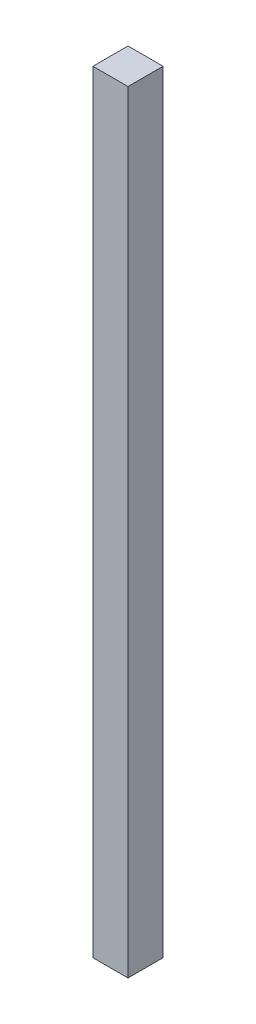
ISO-10303-21;
HEADER;
FILE_DESCRIPTION(('STEP AP214'),'2;1');
FILE_NAME('part.step','',(''),(''),'','','');
FILE_SCHEMA(('AUTOMOTIVE_DESIGN { 1 0 10303 214 1 1 1 1 }'));
ENDSEC;
DATA;
#1=APPLICATION_CONTEXT('core data for automotive mechanical design processes');
#2=APPLICATION_PROTOCOL_DEFINITION('international standard','automotive_design',2000,#1);
#3=PRODUCT_CONTEXT('',#1,'mechanical');
#4=PRODUCT('Part','Part','',(#3));
#5=PRODUCT_RELATED_PRODUCT_CATEGORY('part','',(#4));
#6=PRODUCT_DEFINITION_FORMATION('','',#4);
#7=PRODUCT_DEFINITION_CONTEXT('part definition',#1,'design');
#8=PRODUCT_DEFINITION('design','',#6,#7);
#9=PRODUCT_DEFINITION_SHAPE('','',#8);
#10=(LENGTH_UNIT() NAMED_UNIT(*) SI_UNIT(.MILLI.,.METRE.));
#11=(NAMED_UNIT(*) PLANE_ANGLE_UNIT() SI_UNIT($,.RADIAN.));
#12=(NAMED_UNIT(*) SI_UNIT($,.STERADIAN.) SOLID_ANGLE_UNIT());
#13=UNCERTAINTY_MEASURE_WITH_UNIT(LENGTH_MEASURE(1.E-05),#10,'distance_accuracy_value','');
#14=(GEOMETRIC_REPRESENTATION_CONTEXT(3) GLOBAL_UNCERTAINTY_ASSIGNED_CONTEXT((#13)) GLOBAL_UNIT_ASSIGNED_CONTEXT((#10,
#11,#12)) REPRESENTATION_CONTEXT('',''));
#15=CARTESIAN_POINT('',(0.,0.,0.));
#16=DIRECTION('',(0.,0.,1.));
#17=DIRECTION('',(1.,0.,0.));
#18=AXIS2_PLACEMENT_3D('',#15,#16,#17);
#19=CARTESIAN_POINT('',(0.,440.,0.));
#20=DIRECTION('',(-1.,0.,0.));
#21=DIRECTION('',(0.,0.,1.));
#22=AXIS2_PLACEMENT_3D('',#19,#20,#21);
#23=PLANE('',#22);
#24=DIRECTION('',(0.,0.,-1.));
#25=VECTOR('',#24,1.);
#26=CARTESIAN_POINT('',(0.,0.,0.));
#27=LINE('',#26,#25);
#28=CARTESIAN_POINT('',(0.,0.,0.));
#29=VERTEX_POINT('',#28);
#30=CARTESIAN_POINT('',(0.,0.,-20.));
#31=VERTEX_POINT('',#30);
#32=EDGE_CURVE('E96',#29,#31,#27,.T.);
#33=ORIENTED_EDGE('',*,*,#32,.T.);
#34=DIRECTION('',(0.,-1.,0.));
#35=VECTOR('',#34,1.);
#36=CARTESIAN_POINT('',(0.,440.,-20.));
#37=LINE('',#36,#35);
#38=CARTESIAN_POINT('',(0.,440.,-20.));
#39=VERTEX_POINT('',#38);
#40=EDGE_CURVE('E11',#39,#31,#37,.T.);
#41=ORIENTED_EDGE('',*,*,#40,.F.);
#42=DIRECTION('',(0.,0.,-1.));
#43=VECTOR('',#42,1.);
#44=CARTESIAN_POINT('',(0.,440.,0.));
#45=LINE('',#44,#43);
#46=CARTESIAN_POINT('',(0.,440.,0.));
#47=VERTEX_POINT('',#46);
#48=EDGE_CURVE('E84',#47,#39,#45,.T.);
#49=ORIENTED_EDGE('',*,*,#48,.F.);
#50=DIRECTION('',(0.,-1.,0.));
#51=VECTOR('',#50,1.);
#52=CARTESIAN_POINT('',(0.,440.,0.));
#53=LINE('',#52,#51);
#54=EDGE_CURVE('E92',#47,#29,#53,.T.);
#55=ORIENTED_EDGE('',*,*,#54,.T.);
#56=EDGE_LOOP('',(#33,#41,#49,#55));
#57=FACE_BOUND('',#56,.T.);
#58=ADVANCED_FACE('F33',(#57),#23,.F.);
#59=CARTESIAN_POINT('',(0.,440.,-20.));
#60=DIRECTION('',(0.,0.,1.));
#61=DIRECTION('',(1.,0.,0.));
#62=AXIS2_PLACEMENT_3D('',#59,#60,#61);
#63=PLANE('',#62);
#64=DIRECTION('',(-1.,0.,0.));
#65=VECTOR('',#64,1.);
#66=CARTESIAN_POINT('',(0.,0.,-20.));
#67=LINE('',#66,#65);
#68=CARTESIAN_POINT('',(-20.,0.,-20.));
#69=VERTEX_POINT('',#68);
#70=EDGE_CURVE('E88',#31,#69,#67,.T.);
#71=ORIENTED_EDGE('',*,*,#70,.T.);
#72=DIRECTION('',(0.,-1.,0.));
#73=VECTOR('',#72,1.);
#74=CARTESIAN_POINT('',(-20.,440.,-20.));
#75=LINE('',#74,#73);
#76=CARTESIAN_POINT('',(-20.,440.,-20.));
#77=VERTEX_POINT('',#76);
#78=EDGE_CURVE('E41',#77,#69,#75,.T.);
#79=ORIENTED_EDGE('',*,*,#78,.F.);
#80=DIRECTION('',(-1.,0.,0.));
#81=VECTOR('',#80,1.);
#82=CARTESIAN_POINT('',(0.,440.,-20.));
#83=LINE('',#82,#81);
#84=EDGE_CURVE('E79',#39,#77,#83,.T.);
#85=ORIENTED_EDGE('',*,*,#84,.F.);
#86=ORIENTED_EDGE('',*,*,#40,.T.);
#87=EDGE_LOOP('',(#71,#79,#85,#86));
#88=FACE_BOUND('',#87,.T.);
#89=ADVANCED_FACE('F87',(#88),#63,.F.);
#90=CARTESIAN_POINT('',(-20.,440.,0.));
#91=DIRECTION('',(1.,0.,0.));
#92=DIRECTION('',(0.,0.,-1.));
#93=AXIS2_PLACEMENT_3D('',#90,#91,#92);
#94=PLANE('',#93);
#95=DIRECTION('',(0.,0.,1.));
#96=VECTOR('',#95,1.);
#97=CARTESIAN_POINT('',(-20.,0.,0.));
#98=LINE('',#97,#96);
#99=CARTESIAN_POINT('',(-20.,0.,0.));
#100=VERTEX_POINT('',#99);
#101=EDGE_CURVE('E66',#69,#100,#98,.T.);
#102=ORIENTED_EDGE('',*,*,#101,.T.);
#103=DIRECTION('',(0.,-1.,0.));
#104=VECTOR('',#103,1.);
#105=CARTESIAN_POINT('',(-20.,440.,0.));
#106=LINE('',#105,#104);
#107=CARTESIAN_POINT('',(-20.,440.,0.));
#108=VERTEX_POINT('',#107);
#109=EDGE_CURVE('E89',#108,#100,#106,.T.);
#110=ORIENTED_EDGE('',*,*,#109,.F.);
#111=DIRECTION('',(0.,0.,1.));
#112=VECTOR('',#111,1.);
#113=CARTESIAN_POINT('',(-20.,440.,0.));
#114=LINE('',#113,#112);
#115=EDGE_CURVE('E82',#77,#108,#114,.T.);
#116=ORIENTED_EDGE('',*,*,#115,.F.);
#117=ORIENTED_EDGE('',*,*,#78,.T.);
#118=EDGE_LOOP('',(#102,#110,#116,#117));
#119=FACE_BOUND('',#118,.T.);
#120=ADVANCED_FACE('F90',(#119),#94,.F.);
#121=CARTESIAN_POINT('',(0.,440.,0.));
#122=DIRECTION('',(0.,0.,-1.));
#123=DIRECTION('',(-1.,0.,0.));
#124=AXIS2_PLACEMENT_3D('',#121,#122,#123);
#125=PLANE('',#124);
#126=DIRECTION('',(1.,0.,0.));
#127=VECTOR('',#126,1.);
#128=CARTESIAN_POINT('',(0.,0.,0.));
#129=LINE('',#128,#127);
#130=EDGE_CURVE('E72',#100,#29,#129,.T.);
#131=ORIENTED_EDGE('',*,*,#130,.T.);
#132=ORIENTED_EDGE('',*,*,#54,.F.);
#133=DIRECTION('',(1.,0.,0.));
#134=VECTOR('',#133,1.);
#135=CARTESIAN_POINT('',(0.,440.,0.));
#136=LINE('',#135,#134);
#137=EDGE_CURVE('E49',#108,#47,#136,.T.);
#138=ORIENTED_EDGE('',*,*,#137,.F.);
#139=ORIENTED_EDGE('',*,*,#109,.T.);
#140=EDGE_LOOP('',(#131,#132,#138,#139));
#141=FACE_BOUND('',#140,.T.);
#142=ADVANCED_FACE('F103',(#141),#125,.F.);
#143=CARTESIAN_POINT('',(0.,440.,0.));
#144=DIRECTION('',(0.,1.,0.));
#145=DIRECTION('',(0.,0.,1.));
#146=AXIS2_PLACEMENT_3D('',#143,#144,#145);
#147=PLANE('',#146);
#148=ORIENTED_EDGE('',*,*,#48,.T.);
#149=ORIENTED_EDGE('',*,*,#84,.T.);
#150=ORIENTED_EDGE('',*,*,#115,.T.);
#151=ORIENTED_EDGE('',*,*,#137,.T.);
#152=EDGE_LOOP('',(#148,#149,#150,#151));
#153=FACE_BOUND('',#152,.T.);
#154=ADVANCED_FACE('F80',(#153),#147,.T.);
#155=CARTESIAN_POINT('',(0.,0.,0.));
#156=DIRECTION('',(0.,1.,0.));
#157=DIRECTION('',(0.,0.,1.));
#158=AXIS2_PLACEMENT_3D('',#155,#156,#157);
#159=PLANE('',#158);
#160=ORIENTED_EDGE('',*,*,#32,.F.);
#161=ORIENTED_EDGE('',*,*,#130,.F.);
#162=ORIENTED_EDGE('',*,*,#101,.F.);
#163=ORIENTED_EDGE('',*,*,#70,.F.);
#164=EDGE_LOOP('',(#160,#161,#162,#163));
#165=FACE_BOUND('',#164,.T.);
#166=ADVANCED_FACE('F106',(#165),#159,.F.);
#167=CLOSED_SHELL('',(#58,#89,#120,#142,#154,#166));
#168=MANIFOLD_SOLID_BREP('B2',#167);
#169=ADVANCED_BREP_SHAPE_REPRESENTATION('',(#18,#168),#14);
#170=SHAPE_DEFINITION_REPRESENTATION(#9,#169);
ENDSEC;
END-ISO-10303-21;
